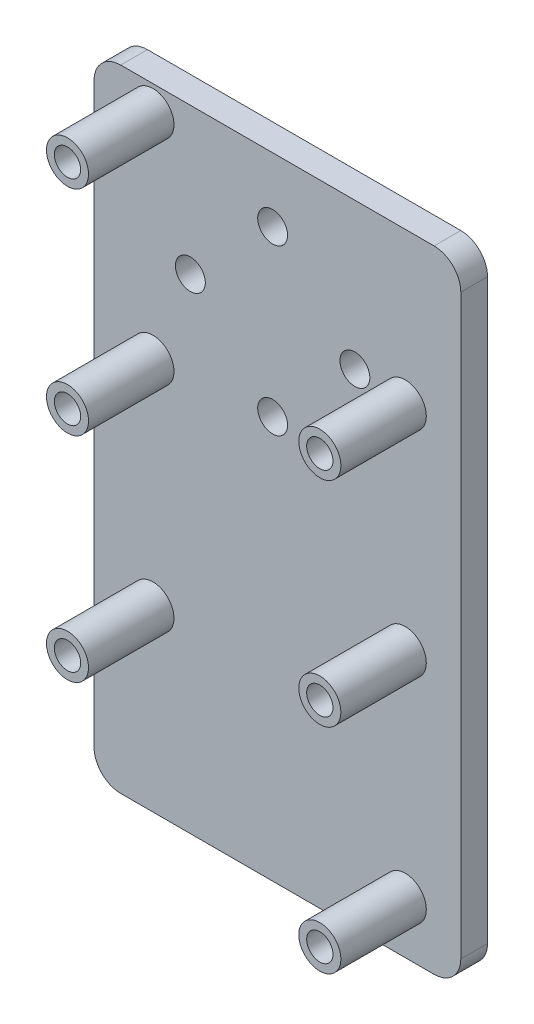
ISO-10303-21;
HEADER;
FILE_DESCRIPTION(('STEP AP214'),'2;1');
FILE_NAME('part.step','',(''),(''),'','','');
FILE_SCHEMA(('AUTOMOTIVE_DESIGN { 1 0 10303 214 1 1 1 1 }'));
ENDSEC;
DATA;
#1=APPLICATION_CONTEXT('core data for automotive mechanical design processes');
#2=APPLICATION_PROTOCOL_DEFINITION('international standard','automotive_design',2000,#1);
#3=PRODUCT_CONTEXT('',#1,'mechanical');
#4=PRODUCT('Part','Part','',(#3));
#5=PRODUCT_RELATED_PRODUCT_CATEGORY('part','',(#4));
#6=PRODUCT_DEFINITION_FORMATION('','',#4);
#7=PRODUCT_DEFINITION_CONTEXT('part definition',#1,'design');
#8=PRODUCT_DEFINITION('design','',#6,#7);
#9=PRODUCT_DEFINITION_SHAPE('','',#8);
#10=(LENGTH_UNIT() NAMED_UNIT(*) SI_UNIT(.MILLI.,.METRE.));
#11=(NAMED_UNIT(*) PLANE_ANGLE_UNIT() SI_UNIT($,.RADIAN.));
#12=(NAMED_UNIT(*) SI_UNIT($,.STERADIAN.) SOLID_ANGLE_UNIT());
#13=UNCERTAINTY_MEASURE_WITH_UNIT(LENGTH_MEASURE(1.E-05),#10,'distance_accuracy_value','');
#14=(GEOMETRIC_REPRESENTATION_CONTEXT(3) GLOBAL_UNCERTAINTY_ASSIGNED_CONTEXT((#13)) GLOBAL_UNIT_ASSIGNED_CONTEXT((#10,
#11,#12)) REPRESENTATION_CONTEXT('',''));
#15=CARTESIAN_POINT('',(0.,0.,0.));
#16=DIRECTION('',(0.,0.,1.));
#17=DIRECTION('',(1.,0.,0.));
#18=AXIS2_PLACEMENT_3D('',#15,#16,#17);
#19=CARTESIAN_POINT('',(37.,-68.8,13.335));
#20=DIRECTION('',(0.,0.,-1.));
#21=DIRECTION('',(-1.,0.,0.));
#22=AXIS2_PLACEMENT_3D('',#19,#20,#21);
#23=CYLINDRICAL_SURFACE('',#22,2.5);
#24=CARTESIAN_POINT('',(37.,-68.8,13.335));
#25=DIRECTION('',(0.,0.,1.));
#26=DIRECTION('',(1.,0.,0.));
#27=AXIS2_PLACEMENT_3D('',#24,#25,#26);
#28=CIRCLE('',#27,2.5);
#29=CARTESIAN_POINT('',(39.5,-68.8,13.335));
#30=VERTEX_POINT('',#29);
#31=EDGE_CURVE('E162',#30,#30,#28,.T.);
#32=ORIENTED_EDGE('',*,*,#31,.F.);
#33=EDGE_LOOP('',(#32));
#34=FACE_BOUND('',#33,.T.);
#35=CARTESIAN_POINT('',(37.,-68.8,3.175));
#36=DIRECTION('',(0.,0.,1.));
#37=DIRECTION('',(1.,0.,0.));
#38=AXIS2_PLACEMENT_3D('',#35,#36,#37);
#39=CIRCLE('',#38,2.5);
#40=CARTESIAN_POINT('',(39.5,-68.8,3.175));
#41=VERTEX_POINT('',#40);
#42=EDGE_CURVE('E159',#41,#41,#39,.T.);
#43=ORIENTED_EDGE('',*,*,#42,.T.);
#44=EDGE_LOOP('',(#43));
#45=FACE_BOUND('',#44,.T.);
#46=ADVANCED_FACE('F37',(#34,#45),#23,.T.);
#47=CARTESIAN_POINT('',(37.,-68.8,13.335));
#48=DIRECTION('',(0.,0.,1.));
#49=DIRECTION('',(1.,0.,0.));
#50=AXIS2_PLACEMENT_3D('',#47,#48,#49);
#51=PLANE('',#50);
#52=CARTESIAN_POINT('',(37.,-68.8,13.335));
#53=DIRECTION('',(0.,0.,1.));
#54=DIRECTION('',(1.,0.,0.));
#55=AXIS2_PLACEMENT_3D('',#52,#53,#54);
#56=CIRCLE('',#55,1.563497);
#57=CARTESIAN_POINT('',(38.563497,-68.8,13.335));
#58=VERTEX_POINT('',#57);
#59=EDGE_CURVE('E256',#58,#58,#56,.T.);
#60=ORIENTED_EDGE('',*,*,#59,.F.);
#61=EDGE_LOOP('',(#60));
#62=FACE_BOUND('',#61,.T.);
#63=ORIENTED_EDGE('',*,*,#31,.T.);
#64=EDGE_LOOP('',(#63));
#65=FACE_BOUND('',#64,.T.);
#66=ADVANCED_FACE('F304',(#62,#65),#51,.T.);
#67=CARTESIAN_POINT('',(7.00000000000001,-53.8,13.335));
#68=DIRECTION('',(0.,0.,-1.));
#69=DIRECTION('',(-1.,0.,0.));
#70=AXIS2_PLACEMENT_3D('',#67,#68,#69);
#71=CYLINDRICAL_SURFACE('',#70,2.5);
#72=CARTESIAN_POINT('',(7.00000000000001,-53.8,13.335));
#73=DIRECTION('',(0.,0.,1.));
#74=DIRECTION('',(1.,0.,0.));
#75=AXIS2_PLACEMENT_3D('',#72,#73,#74);
#76=CIRCLE('',#75,2.5);
#77=CARTESIAN_POINT('',(9.50000000000001,-53.8,13.335));
#78=VERTEX_POINT('',#77);
#79=EDGE_CURVE('E156',#78,#78,#76,.T.);
#80=ORIENTED_EDGE('',*,*,#79,.F.);
#81=EDGE_LOOP('',(#80));
#82=FACE_BOUND('',#81,.T.);
#83=CARTESIAN_POINT('',(7.00000000000001,-53.8,3.175));
#84=DIRECTION('',(0.,0.,1.));
#85=DIRECTION('',(1.,0.,0.));
#86=AXIS2_PLACEMENT_3D('',#83,#84,#85);
#87=CIRCLE('',#86,2.5);
#88=CARTESIAN_POINT('',(9.50000000000001,-53.8,3.175));
#89=VERTEX_POINT('',#88);
#90=EDGE_CURVE('E153',#89,#89,#87,.T.);
#91=ORIENTED_EDGE('',*,*,#90,.T.);
#92=EDGE_LOOP('',(#91));
#93=FACE_BOUND('',#92,.T.);
#94=ADVANCED_FACE('F310',(#82,#93),#71,.T.);
#95=CARTESIAN_POINT('',(7.00000000000001,-53.8,13.335));
#96=DIRECTION('',(0.,0.,1.));
#97=DIRECTION('',(1.,0.,0.));
#98=AXIS2_PLACEMENT_3D('',#95,#96,#97);
#99=PLANE('',#98);
#100=CARTESIAN_POINT('',(7.00000000000001,-53.8,13.335));
#101=DIRECTION('',(0.,0.,1.));
#102=DIRECTION('',(1.,0.,0.));
#103=AXIS2_PLACEMENT_3D('',#100,#101,#102);
#104=CIRCLE('',#103,1.563497);
#105=CARTESIAN_POINT('',(8.56349700000001,-53.8,13.335));
#106=VERTEX_POINT('',#105);
#107=EDGE_CURVE('E192',#106,#106,#104,.T.);
#108=ORIENTED_EDGE('',*,*,#107,.F.);
#109=EDGE_LOOP('',(#108));
#110=FACE_BOUND('',#109,.T.);
#111=ORIENTED_EDGE('',*,*,#79,.T.);
#112=EDGE_LOOP('',(#111));
#113=FACE_BOUND('',#112,.T.);
#114=ADVANCED_FACE('F396',(#110,#113),#99,.T.);
#115=CARTESIAN_POINT('',(0.,0.,3.175));
#116=DIRECTION('',(1.,0.,0.));
#117=DIRECTION('',(0.,1.,0.));
#118=AXIS2_PLACEMENT_3D('',#115,#116,#117);
#119=PLANE('',#118);
#120=DIRECTION('',(0.,-1.,0.));
#121=VECTOR('',#120,1.);
#122=CARTESIAN_POINT('',(0.,0.,3.175));
#123=LINE('',#122,#121);
#124=CARTESIAN_POINT('',(0.,-3.175,3.175));
#125=VERTEX_POINT('',#124);
#126=CARTESIAN_POINT('',(0.,-71.825,3.175));
#127=VERTEX_POINT('',#126);
#128=EDGE_CURVE('E123',#125,#127,#123,.T.);
#129=ORIENTED_EDGE('',*,*,#128,.F.);
#130=DIRECTION('',(0.,0.,-1.));
#131=VECTOR('',#130,1.);
#132=CARTESIAN_POINT('',(0.,-3.175,3.175));
#133=LINE('',#132,#131);
#134=CARTESIAN_POINT('',(0.,-3.175,0.));
#135=VERTEX_POINT('',#134);
#136=EDGE_CURVE('E107',#125,#135,#133,.T.);
#137=ORIENTED_EDGE('',*,*,#136,.T.);
#138=DIRECTION('',(0.,-1.,0.));
#139=VECTOR('',#138,1.);
#140=CARTESIAN_POINT('',(0.,0.,0.));
#141=LINE('',#140,#139);
#142=CARTESIAN_POINT('',(0.,-71.825,0.));
#143=VERTEX_POINT('',#142);
#144=EDGE_CURVE('E120',#135,#143,#141,.T.);
#145=ORIENTED_EDGE('',*,*,#144,.T.);
#146=DIRECTION('',(0.,0.,-1.));
#147=VECTOR('',#146,1.);
#148=CARTESIAN_POINT('',(0.,-71.825,3.175));
#149=LINE('',#148,#147);
#150=EDGE_CURVE('E125',#143,#127,#149,.F.);
#151=ORIENTED_EDGE('',*,*,#150,.T.);
#152=EDGE_LOOP('',(#129,#137,#145,#151));
#153=FACE_BOUND('',#152,.T.);
#154=ADVANCED_FACE('F119',(#153),#119,.F.);
#155=CARTESIAN_POINT('',(0.,-75.,3.175));
#156=DIRECTION('',(0.,1.,0.));
#157=DIRECTION('',(0.,0.,1.));
#158=AXIS2_PLACEMENT_3D('',#155,#156,#157);
#159=PLANE('',#158);
#160=DIRECTION('',(1.,0.,0.));
#161=VECTOR('',#160,1.);
#162=CARTESIAN_POINT('',(0.,-75.,0.));
#163=LINE('',#162,#161);
#164=CARTESIAN_POINT('',(3.17500000000002,-75.,0.));
#165=VERTEX_POINT('',#164);
#166=CARTESIAN_POINT('',(40.425,-75.,0.));
#167=VERTEX_POINT('',#166);
#168=EDGE_CURVE('E129',#165,#167,#163,.T.);
#169=ORIENTED_EDGE('',*,*,#168,.T.);
#170=DIRECTION('',(0.,0.,-1.));
#171=VECTOR('',#170,1.);
#172=CARTESIAN_POINT('',(40.425,-75.,3.175));
#173=LINE('',#172,#171);
#174=CARTESIAN_POINT('',(40.425,-75.,3.175));
#175=VERTEX_POINT('',#174);
#176=EDGE_CURVE('E11',#167,#175,#173,.F.);
#177=ORIENTED_EDGE('',*,*,#176,.T.);
#178=DIRECTION('',(1.,0.,0.));
#179=VECTOR('',#178,1.);
#180=CARTESIAN_POINT('',(0.,-75.,3.175));
#181=LINE('',#180,#179);
#182=CARTESIAN_POINT('',(3.17500000000002,-75.,3.175));
#183=VERTEX_POINT('',#182);
#184=EDGE_CURVE('E217',#183,#175,#181,.T.);
#185=ORIENTED_EDGE('',*,*,#184,.F.);
#186=DIRECTION('',(0.,0.,-1.));
#187=VECTOR('',#186,1.);
#188=CARTESIAN_POINT('',(3.17500000000002,-75.,3.175));
#189=LINE('',#188,#187);
#190=EDGE_CURVE('E45',#183,#165,#189,.T.);
#191=ORIENTED_EDGE('',*,*,#190,.T.);
#192=EDGE_LOOP('',(#169,#177,#185,#191));
#193=FACE_BOUND('',#192,.T.);
#194=ADVANCED_FACE('F215',(#193),#159,.F.);
#195=CARTESIAN_POINT('',(43.6,0.,3.175));
#196=DIRECTION('',(-1.,0.,0.));
#197=DIRECTION('',(0.,-1.,0.));
#198=AXIS2_PLACEMENT_3D('',#195,#196,#197);
#199=PLANE('',#198);
#200=DIRECTION('',(0.,1.,0.));
#201=VECTOR('',#200,1.);
#202=CARTESIAN_POINT('',(43.6,0.,0.));
#203=LINE('',#202,#201);
#204=CARTESIAN_POINT('',(43.6,-71.825,0.));
#205=VERTEX_POINT('',#204);
#206=CARTESIAN_POINT('',(43.6,-3.175,0.));
#207=VERTEX_POINT('',#206);
#208=EDGE_CURVE('E133',#205,#207,#203,.T.);
#209=ORIENTED_EDGE('',*,*,#208,.T.);
#210=DIRECTION('',(0.,0.,-1.));
#211=VECTOR('',#210,1.);
#212=CARTESIAN_POINT('',(43.6,-3.175,3.175));
#213=LINE('',#212,#211);
#214=CARTESIAN_POINT('',(43.6,-3.175,3.175));
#215=VERTEX_POINT('',#214);
#216=EDGE_CURVE('E52',#207,#215,#213,.F.);
#217=ORIENTED_EDGE('',*,*,#216,.T.);
#218=DIRECTION('',(0.,1.,0.));
#219=VECTOR('',#218,1.);
#220=CARTESIAN_POINT('',(43.6,0.,3.175));
#221=LINE('',#220,#219);
#222=CARTESIAN_POINT('',(43.6,-71.825,3.175));
#223=VERTEX_POINT('',#222);
#224=EDGE_CURVE('E225',#223,#215,#221,.T.);
#225=ORIENTED_EDGE('',*,*,#224,.F.);
#226=DIRECTION('',(0.,0.,-1.));
#227=VECTOR('',#226,1.);
#228=CARTESIAN_POINT('',(43.6,-71.825,3.175));
#229=LINE('',#228,#227);
#230=EDGE_CURVE('E208',#223,#205,#229,.T.);
#231=ORIENTED_EDGE('',*,*,#230,.T.);
#232=EDGE_LOOP('',(#209,#217,#225,#231));
#233=FACE_BOUND('',#232,.T.);
#234=ADVANCED_FACE('F224',(#233),#199,.F.);
#235=CARTESIAN_POINT('',(0.,0.,3.175));
#236=DIRECTION('',(0.,-1.,0.));
#237=DIRECTION('',(0.,0.,-1.));
#238=AXIS2_PLACEMENT_3D('',#235,#236,#237);
#239=PLANE('',#238);
#240=DIRECTION('',(-1.,0.,0.));
#241=VECTOR('',#240,1.);
#242=CARTESIAN_POINT('',(0.,0.,0.));
#243=LINE('',#242,#241);
#244=CARTESIAN_POINT('',(40.425,0.,0.));
#245=VERTEX_POINT('',#244);
#246=CARTESIAN_POINT('',(3.175,0.,0.));
#247=VERTEX_POINT('',#246);
#248=EDGE_CURVE('E143',#245,#247,#243,.T.);
#249=ORIENTED_EDGE('',*,*,#248,.T.);
#250=DIRECTION('',(0.,0.,-1.));
#251=VECTOR('',#250,1.);
#252=CARTESIAN_POINT('',(3.175,0.,3.175));
#253=LINE('',#252,#251);
#254=CARTESIAN_POINT('',(3.175,0.,3.175));
#255=VERTEX_POINT('',#254);
#256=EDGE_CURVE('E108',#247,#255,#253,.F.);
#257=ORIENTED_EDGE('',*,*,#256,.T.);
#258=DIRECTION('',(-1.,0.,0.));
#259=VECTOR('',#258,1.);
#260=CARTESIAN_POINT('',(0.,0.,3.175));
#261=LINE('',#260,#259);
#262=CARTESIAN_POINT('',(40.425,0.,3.175));
#263=VERTEX_POINT('',#262);
#264=EDGE_CURVE('E139',#263,#255,#261,.T.);
#265=ORIENTED_EDGE('',*,*,#264,.F.);
#266=DIRECTION('',(0.,0.,-1.));
#267=VECTOR('',#266,1.);
#268=CARTESIAN_POINT('',(40.425,0.,3.175));
#269=LINE('',#268,#267);
#270=EDGE_CURVE('E113',#263,#245,#269,.T.);
#271=ORIENTED_EDGE('',*,*,#270,.T.);
#272=EDGE_LOOP('',(#249,#257,#265,#271));
#273=FACE_BOUND('',#272,.T.);
#274=ADVANCED_FACE('F282',(#273),#239,.F.);
#275=CARTESIAN_POINT('',(0.,0.,3.175));
#276=DIRECTION('',(0.,0.,1.));
#277=DIRECTION('',(1.,0.,0.));
#278=AXIS2_PLACEMENT_3D('',#275,#276,#277);
#279=PLANE('',#278);
#280=CARTESIAN_POINT('',(21.2289321259542,-7.62,3.175));
#281=DIRECTION('',(0.,0.,1.));
#282=DIRECTION('',(1.,0.,0.));
#283=AXIS2_PLACEMENT_3D('',#280,#281,#282);
#284=CIRCLE('',#283,1.778);
#285=CARTESIAN_POINT('',(23.0069321259542,-7.62,3.175));
#286=VERTEX_POINT('',#285);
#287=EDGE_CURVE('E183',#286,#286,#284,.T.);
#288=ORIENTED_EDGE('',*,*,#287,.F.);
#289=EDGE_LOOP('',(#288));
#290=FACE_BOUND('',#289,.T.);
#291=CARTESIAN_POINT('',(21.2289321259542,-27.178,3.175));
#292=DIRECTION('',(0.,0.,1.));
#293=DIRECTION('',(1.,0.,0.));
#294=AXIS2_PLACEMENT_3D('',#291,#292,#293);
#295=CIRCLE('',#294,1.77800000000001);
#296=CARTESIAN_POINT('',(23.0069321259542,-27.178,3.175));
#297=VERTEX_POINT('',#296);
#298=EDGE_CURVE('E270',#297,#297,#295,.T.);
#299=ORIENTED_EDGE('',*,*,#298,.F.);
#300=EDGE_LOOP('',(#299));
#301=FACE_BOUND('',#300,.T.);
#302=CARTESIAN_POINT('',(11.4499321259542,-17.399,3.175));
#303=DIRECTION('',(0.,0.,1.));
#304=DIRECTION('',(1.,0.,0.));
#305=AXIS2_PLACEMENT_3D('',#302,#303,#304);
#306=CIRCLE('',#305,1.778);
#307=CARTESIAN_POINT('',(13.2279321259542,-17.399,3.175));
#308=VERTEX_POINT('',#307);
#309=EDGE_CURVE('E267',#308,#308,#306,.T.);
#310=ORIENTED_EDGE('',*,*,#309,.F.);
#311=EDGE_LOOP('',(#310));
#312=FACE_BOUND('',#311,.T.);
#313=CARTESIAN_POINT('',(31.0079321259542,-17.399,3.175));
#314=DIRECTION('',(0.,0.,1.));
#315=DIRECTION('',(1.,0.,0.));
#316=AXIS2_PLACEMENT_3D('',#313,#314,#315);
#317=CIRCLE('',#316,1.778);
#318=CARTESIAN_POINT('',(32.7859321259542,-17.399,3.175));
#319=VERTEX_POINT('',#318);
#320=EDGE_CURVE('E264',#319,#319,#317,.T.);
#321=ORIENTED_EDGE('',*,*,#320,.F.);
#322=EDGE_LOOP('',(#321));
#323=FACE_BOUND('',#322,.T.);
#324=CARTESIAN_POINT('',(37.,-43.4,3.175));
#325=DIRECTION('',(0.,0.,1.));
#326=DIRECTION('',(1.,0.,0.));
#327=AXIS2_PLACEMENT_3D('',#324,#325,#326);
#328=CIRCLE('',#327,2.5);
#329=CARTESIAN_POINT('',(39.5,-43.4,3.175));
#330=VERTEX_POINT('',#329);
#331=EDGE_CURVE('E178',#330,#330,#328,.T.);
#332=ORIENTED_EDGE('',*,*,#331,.F.);
#333=EDGE_LOOP('',(#332));
#334=FACE_BOUND('',#333,.T.);
#335=CARTESIAN_POINT('',(7.00000000000001,-28.4,3.175));
#336=DIRECTION('',(0.,0.,1.));
#337=DIRECTION('',(1.,0.,0.));
#338=AXIS2_PLACEMENT_3D('',#335,#336,#337);
#339=CIRCLE('',#338,2.5);
#340=CARTESIAN_POINT('',(9.50000000000001,-28.4,3.175));
#341=VERTEX_POINT('',#340);
#342=EDGE_CURVE('E246',#341,#341,#339,.T.);
#343=ORIENTED_EDGE('',*,*,#342,.F.);
#344=EDGE_LOOP('',(#343));
#345=FACE_BOUND('',#344,.T.);
#346=CARTESIAN_POINT('',(7.,-3.,3.175));
#347=DIRECTION('',(0.,0.,1.));
#348=DIRECTION('',(1.,0.,0.));
#349=AXIS2_PLACEMENT_3D('',#346,#347,#348);
#350=CIRCLE('',#349,2.5);
#351=CARTESIAN_POINT('',(9.5,-3.,3.175));
#352=VERTEX_POINT('',#351);
#353=EDGE_CURVE('E237',#352,#352,#350,.T.);
#354=ORIENTED_EDGE('',*,*,#353,.F.);
#355=EDGE_LOOP('',(#354));
#356=FACE_BOUND('',#355,.T.);
#357=CARTESIAN_POINT('',(37.,-18.,3.175));
#358=DIRECTION('',(0.,0.,1.));
#359=DIRECTION('',(1.,0.,0.));
#360=AXIS2_PLACEMENT_3D('',#357,#358,#359);
#361=CIRCLE('',#360,2.5);
#362=CARTESIAN_POINT('',(39.5,-18.,3.175));
#363=VERTEX_POINT('',#362);
#364=EDGE_CURVE('E136',#363,#363,#361,.T.);
#365=ORIENTED_EDGE('',*,*,#364,.F.);
#366=EDGE_LOOP('',(#365));
#367=FACE_BOUND('',#366,.T.);
#368=ORIENTED_EDGE('',*,*,#264,.T.);
#369=CARTESIAN_POINT('',(3.175,-3.175,3.175));
#370=DIRECTION('',(0.,0.,1.));
#371=DIRECTION('',(1.,0.,0.));
#372=AXIS2_PLACEMENT_3D('',#369,#370,#371);
#373=CIRCLE('',#372,3.175);
#374=EDGE_CURVE('E206',#255,#125,#373,.T.);
#375=ORIENTED_EDGE('',*,*,#374,.T.);
#376=ORIENTED_EDGE('',*,*,#128,.T.);
#377=CARTESIAN_POINT('',(3.17500000000002,-71.825,3.175));
#378=DIRECTION('',(0.,0.,1.));
#379=DIRECTION('',(1.,0.,0.));
#380=AXIS2_PLACEMENT_3D('',#377,#378,#379);
#381=CIRCLE('',#380,3.175);
#382=EDGE_CURVE('E201',#127,#183,#381,.T.);
#383=ORIENTED_EDGE('',*,*,#382,.T.);
#384=ORIENTED_EDGE('',*,*,#184,.T.);
#385=CARTESIAN_POINT('',(40.425,-71.825,3.175));
#386=DIRECTION('',(0.,0.,1.));
#387=DIRECTION('',(1.,0.,0.));
#388=AXIS2_PLACEMENT_3D('',#385,#386,#387);
#389=CIRCLE('',#388,3.175);
#390=EDGE_CURVE('E59',#175,#223,#389,.T.);
#391=ORIENTED_EDGE('',*,*,#390,.T.);
#392=ORIENTED_EDGE('',*,*,#224,.T.);
#393=CARTESIAN_POINT('',(40.425,-3.175,3.175));
#394=DIRECTION('',(0.,0.,1.));
#395=DIRECTION('',(1.,0.,0.));
#396=AXIS2_PLACEMENT_3D('',#393,#394,#395);
#397=CIRCLE('',#396,3.175);
#398=EDGE_CURVE('E204',#215,#263,#397,.T.);
#399=ORIENTED_EDGE('',*,*,#398,.T.);
#400=EDGE_LOOP('',(#368,#375,#376,#383,#384,#391,#392,#399));
#401=FACE_BOUND('',#400,.T.);
#402=ORIENTED_EDGE('',*,*,#90,.F.);
#403=EDGE_LOOP('',(#402));
#404=FACE_BOUND('',#403,.T.);
#405=ORIENTED_EDGE('',*,*,#42,.F.);
#406=EDGE_LOOP('',(#405));
#407=FACE_BOUND('',#406,.T.);
#408=ADVANCED_FACE('F279',(#290,#301,#312,#323,#334,#345,#356,#367,#401,#404,#407),#279,.T.);
#409=CARTESIAN_POINT('',(0.,0.,0.));
#410=DIRECTION('',(0.,0.,1.));
#411=DIRECTION('',(1.,0.,0.));
#412=AXIS2_PLACEMENT_3D('',#409,#410,#411);
#413=PLANE('',#412);
#414=CARTESIAN_POINT('',(21.2289321259542,-7.62,0.));
#415=DIRECTION('',(0.,0.,1.));
#416=DIRECTION('',(1.,0.,0.));
#417=AXIS2_PLACEMENT_3D('',#414,#415,#416);
#418=CIRCLE('',#417,1.778);
#419=CARTESIAN_POINT('',(23.0069321259542,-7.62,0.));
#420=VERTEX_POINT('',#419);
#421=EDGE_CURVE('E189',#420,#420,#418,.T.);
#422=ORIENTED_EDGE('',*,*,#421,.T.);
#423=EDGE_LOOP('',(#422));
#424=FACE_BOUND('',#423,.T.);
#425=CARTESIAN_POINT('',(21.2289321259542,-27.178,0.));
#426=DIRECTION('',(0.,0.,1.));
#427=DIRECTION('',(1.,0.,0.));
#428=AXIS2_PLACEMENT_3D('',#425,#426,#427);
#429=CIRCLE('',#428,1.77800000000001);
#430=CARTESIAN_POINT('',(23.0069321259542,-27.178,0.));
#431=VERTEX_POINT('',#430);
#432=EDGE_CURVE('E186',#431,#431,#429,.T.);
#433=ORIENTED_EDGE('',*,*,#432,.T.);
#434=EDGE_LOOP('',(#433));
#435=FACE_BOUND('',#434,.T.);
#436=CARTESIAN_POINT('',(11.4499321259542,-17.399,0.));
#437=DIRECTION('',(0.,0.,1.));
#438=DIRECTION('',(1.,0.,0.));
#439=AXIS2_PLACEMENT_3D('',#436,#437,#438);
#440=CIRCLE('',#439,1.778);
#441=CARTESIAN_POINT('',(13.2279321259542,-17.399,0.));
#442=VERTEX_POINT('',#441);
#443=EDGE_CURVE('E182',#442,#442,#440,.T.);
#444=ORIENTED_EDGE('',*,*,#443,.T.);
#445=EDGE_LOOP('',(#444));
#446=FACE_BOUND('',#445,.T.);
#447=CARTESIAN_POINT('',(31.0079321259542,-17.399,0.));
#448=DIRECTION('',(0.,0.,1.));
#449=DIRECTION('',(1.,0.,0.));
#450=AXIS2_PLACEMENT_3D('',#447,#448,#449);
#451=CIRCLE('',#450,1.778);
#452=CARTESIAN_POINT('',(32.7859321259542,-17.399,0.));
#453=VERTEX_POINT('',#452);
#454=EDGE_CURVE('E179',#453,#453,#451,.T.);
#455=ORIENTED_EDGE('',*,*,#454,.T.);
#456=EDGE_LOOP('',(#455));
#457=FACE_BOUND('',#456,.T.);
#458=CARTESIAN_POINT('',(7.00000000000001,-28.4,0.));
#459=DIRECTION('',(0.,0.,1.));
#460=DIRECTION('',(1.,0.,0.));
#461=AXIS2_PLACEMENT_3D('',#458,#459,#460);
#462=CIRCLE('',#461,1.563497);
#463=CARTESIAN_POINT('',(8.56349700000001,-28.4,0.));
#464=VERTEX_POINT('',#463);
#465=EDGE_CURVE('E175',#464,#464,#462,.T.);
#466=ORIENTED_EDGE('',*,*,#465,.T.);
#467=EDGE_LOOP('',(#466));
#468=FACE_BOUND('',#467,.T.);
#469=CARTESIAN_POINT('',(37.,-43.4,0.));
#470=DIRECTION('',(0.,0.,1.));
#471=DIRECTION('',(1.,0.,0.));
#472=AXIS2_PLACEMENT_3D('',#469,#470,#471);
#473=CIRCLE('',#472,1.563497);
#474=CARTESIAN_POINT('',(38.563497,-43.4,0.));
#475=VERTEX_POINT('',#474);
#476=EDGE_CURVE('E172',#475,#475,#473,.T.);
#477=ORIENTED_EDGE('',*,*,#476,.T.);
#478=EDGE_LOOP('',(#477));
#479=FACE_BOUND('',#478,.T.);
#480=CARTESIAN_POINT('',(7.00000000000001,-53.8,0.));
#481=DIRECTION('',(0.,0.,1.));
#482=DIRECTION('',(1.,0.,0.));
#483=AXIS2_PLACEMENT_3D('',#480,#481,#482);
#484=CIRCLE('',#483,1.563497);
#485=CARTESIAN_POINT('',(8.56349700000001,-53.8,0.));
#486=VERTEX_POINT('',#485);
#487=EDGE_CURVE('E168',#486,#486,#484,.T.);
#488=ORIENTED_EDGE('',*,*,#487,.T.);
#489=EDGE_LOOP('',(#488));
#490=FACE_BOUND('',#489,.T.);
#491=CARTESIAN_POINT('',(37.,-68.8,0.));
#492=DIRECTION('',(0.,0.,1.));
#493=DIRECTION('',(1.,0.,0.));
#494=AXIS2_PLACEMENT_3D('',#491,#492,#493);
#495=CIRCLE('',#494,1.563497);
#496=CARTESIAN_POINT('',(38.563497,-68.8,0.));
#497=VERTEX_POINT('',#496);
#498=EDGE_CURVE('E165',#497,#497,#495,.T.);
#499=ORIENTED_EDGE('',*,*,#498,.T.);
#500=EDGE_LOOP('',(#499));
#501=FACE_BOUND('',#500,.T.);
#502=CARTESIAN_POINT('',(7.,-3.,0.));
#503=DIRECTION('',(0.,0.,1.));
#504=DIRECTION('',(1.,0.,0.));
#505=AXIS2_PLACEMENT_3D('',#502,#503,#504);
#506=CIRCLE('',#505,1.563497);
#507=CARTESIAN_POINT('',(8.563497,-3.,0.));
#508=VERTEX_POINT('',#507);
#509=EDGE_CURVE('E148',#508,#508,#506,.T.);
#510=ORIENTED_EDGE('',*,*,#509,.T.);
#511=EDGE_LOOP('',(#510));
#512=FACE_BOUND('',#511,.T.);
#513=CARTESIAN_POINT('',(37.,-18.,0.));
#514=DIRECTION('',(0.,0.,1.));
#515=DIRECTION('',(1.,0.,0.));
#516=AXIS2_PLACEMENT_3D('',#513,#514,#515);
#517=CIRCLE('',#516,1.563497);
#518=CARTESIAN_POINT('',(38.563497,-18.,0.));
#519=VERTEX_POINT('',#518);
#520=EDGE_CURVE('E145',#519,#519,#517,.T.);
#521=ORIENTED_EDGE('',*,*,#520,.T.);
#522=EDGE_LOOP('',(#521));
#523=FACE_BOUND('',#522,.T.);
#524=ORIENTED_EDGE('',*,*,#144,.F.);
#525=CARTESIAN_POINT('',(3.175,-3.175,0.));
#526=DIRECTION('',(0.,0.,1.));
#527=DIRECTION('',(1.,0.,0.));
#528=AXIS2_PLACEMENT_3D('',#525,#526,#527);
#529=CIRCLE('',#528,3.175);
#530=EDGE_CURVE('E103',#135,#247,#529,.F.);
#531=ORIENTED_EDGE('',*,*,#530,.T.);
#532=ORIENTED_EDGE('',*,*,#248,.F.);
#533=CARTESIAN_POINT('',(40.425,-3.175,0.));
#534=DIRECTION('',(0.,0.,1.));
#535=DIRECTION('',(1.,0.,0.));
#536=AXIS2_PLACEMENT_3D('',#533,#534,#535);
#537=CIRCLE('',#536,3.175);
#538=EDGE_CURVE('E114',#245,#207,#537,.F.);
#539=ORIENTED_EDGE('',*,*,#538,.T.);
#540=ORIENTED_EDGE('',*,*,#208,.F.);
#541=CARTESIAN_POINT('',(40.425,-71.825,0.));
#542=DIRECTION('',(0.,0.,1.));
#543=DIRECTION('',(1.,0.,0.));
#544=AXIS2_PLACEMENT_3D('',#541,#542,#543);
#545=CIRCLE('',#544,3.175);
#546=EDGE_CURVE('E195',#205,#167,#545,.F.);
#547=ORIENTED_EDGE('',*,*,#546,.T.);
#548=ORIENTED_EDGE('',*,*,#168,.F.);
#549=CARTESIAN_POINT('',(3.17500000000002,-71.825,0.));
#550=DIRECTION('',(0.,0.,1.));
#551=DIRECTION('',(1.,0.,0.));
#552=AXIS2_PLACEMENT_3D('',#549,#550,#551);
#553=CIRCLE('',#552,3.175);
#554=EDGE_CURVE('E124',#165,#143,#553,.F.);
#555=ORIENTED_EDGE('',*,*,#554,.T.);
#556=EDGE_LOOP('',(#524,#531,#532,#539,#540,#547,#548,#555));
#557=FACE_BOUND('',#556,.T.);
#558=ADVANCED_FACE('F127',(#424,#435,#446,#457,#468,#479,#490,#501,#512,#523,#557),#413,.F.);
#559=CARTESIAN_POINT('',(37.,-18.,13.335));
#560=DIRECTION('',(0.,0.,1.));
#561=DIRECTION('',(1.,0.,0.));
#562=AXIS2_PLACEMENT_3D('',#559,#560,#561);
#563=PLANE('',#562);
#564=CARTESIAN_POINT('',(37.,-18.,13.335));
#565=DIRECTION('',(0.,0.,1.));
#566=DIRECTION('',(1.,0.,0.));
#567=AXIS2_PLACEMENT_3D('',#564,#565,#566);
#568=CIRCLE('',#567,2.5);
#569=CARTESIAN_POINT('',(39.5,-18.,13.335));
#570=VERTEX_POINT('',#569);
#571=EDGE_CURVE('E130',#570,#570,#568,.T.);
#572=ORIENTED_EDGE('',*,*,#571,.T.);
#573=EDGE_LOOP('',(#572));
#574=FACE_BOUND('',#573,.T.);
#575=CARTESIAN_POINT('',(37.,-18.,13.335));
#576=DIRECTION('',(0.,0.,1.));
#577=DIRECTION('',(1.,0.,0.));
#578=AXIS2_PLACEMENT_3D('',#575,#576,#577);
#579=CIRCLE('',#578,1.563497);
#580=CARTESIAN_POINT('',(38.563497,-18.,13.335));
#581=VERTEX_POINT('',#580);
#582=EDGE_CURVE('E232',#581,#581,#579,.T.);
#583=ORIENTED_EDGE('',*,*,#582,.F.);
#584=EDGE_LOOP('',(#583));
#585=FACE_BOUND('',#584,.T.);
#586=ADVANCED_FACE('F354',(#574,#585),#563,.T.);
#587=CARTESIAN_POINT('',(37.,-18.,13.335));
#588=DIRECTION('',(0.,0.,-1.));
#589=DIRECTION('',(-1.,0.,0.));
#590=AXIS2_PLACEMENT_3D('',#587,#588,#589);
#591=CYLINDRICAL_SURFACE('',#590,2.5);
#592=ORIENTED_EDGE('',*,*,#571,.F.);
#593=EDGE_LOOP('',(#592));
#594=FACE_BOUND('',#593,.T.);
#595=ORIENTED_EDGE('',*,*,#364,.T.);
#596=EDGE_LOOP('',(#595));
#597=FACE_BOUND('',#596,.T.);
#598=ADVANCED_FACE('F567',(#594,#597),#591,.T.);
#599=CARTESIAN_POINT('',(37.,-18.,13.335));
#600=DIRECTION('',(0.,0.,-1.));
#601=DIRECTION('',(-1.,0.,0.));
#602=AXIS2_PLACEMENT_3D('',#599,#600,#601);
#603=CYLINDRICAL_SURFACE('',#602,1.563497);
#604=ORIENTED_EDGE('',*,*,#582,.T.);
#605=EDGE_LOOP('',(#604));
#606=FACE_BOUND('',#605,.T.);
#607=ORIENTED_EDGE('',*,*,#520,.F.);
#608=EDGE_LOOP('',(#607));
#609=FACE_BOUND('',#608,.T.);
#610=ADVANCED_FACE('F562',(#606,#609),#603,.F.);
#611=CARTESIAN_POINT('',(7.,-3.,13.335));
#612=DIRECTION('',(0.,0.,1.));
#613=DIRECTION('',(1.,0.,0.));
#614=AXIS2_PLACEMENT_3D('',#611,#612,#613);
#615=PLANE('',#614);
#616=CARTESIAN_POINT('',(7.,-3.,13.335));
#617=DIRECTION('',(0.,0.,1.));
#618=DIRECTION('',(1.,0.,0.));
#619=AXIS2_PLACEMENT_3D('',#616,#617,#618);
#620=CIRCLE('',#619,2.5);
#621=CARTESIAN_POINT('',(9.5,-3.,13.335));
#622=VERTEX_POINT('',#621);
#623=EDGE_CURVE('E236',#622,#622,#620,.T.);
#624=ORIENTED_EDGE('',*,*,#623,.T.);
#625=EDGE_LOOP('',(#624));
#626=FACE_BOUND('',#625,.T.);
#627=CARTESIAN_POINT('',(7.,-3.,13.335));
#628=DIRECTION('',(0.,0.,1.));
#629=DIRECTION('',(1.,0.,0.));
#630=AXIS2_PLACEMENT_3D('',#627,#628,#629);
#631=CIRCLE('',#630,1.563497);
#632=CARTESIAN_POINT('',(8.563497,-3.,13.335));
#633=VERTEX_POINT('',#632);
#634=EDGE_CURVE('E152',#633,#633,#631,.T.);
#635=ORIENTED_EDGE('',*,*,#634,.F.);
#636=EDGE_LOOP('',(#635));
#637=FACE_BOUND('',#636,.T.);
#638=ADVANCED_FACE('F566',(#626,#637),#615,.T.);
#639=CARTESIAN_POINT('',(7.,-3.,13.335));
#640=DIRECTION('',(0.,0.,-1.));
#641=DIRECTION('',(-1.,0.,0.));
#642=AXIS2_PLACEMENT_3D('',#639,#640,#641);
#643=CYLINDRICAL_SURFACE('',#642,2.5);
#644=ORIENTED_EDGE('',*,*,#623,.F.);
#645=EDGE_LOOP('',(#644));
#646=FACE_BOUND('',#645,.T.);
#647=ORIENTED_EDGE('',*,*,#353,.T.);
#648=EDGE_LOOP('',(#647));
#649=FACE_BOUND('',#648,.T.);
#650=ADVANCED_FACE('F553',(#646,#649),#643,.T.);
#651=CARTESIAN_POINT('',(7.,-3.,13.335));
#652=DIRECTION('',(0.,0.,-1.));
#653=DIRECTION('',(-1.,0.,0.));
#654=AXIS2_PLACEMENT_3D('',#651,#652,#653);
#655=CYLINDRICAL_SURFACE('',#654,1.563497);
#656=ORIENTED_EDGE('',*,*,#634,.T.);
#657=EDGE_LOOP('',(#656));
#658=FACE_BOUND('',#657,.T.);
#659=ORIENTED_EDGE('',*,*,#509,.F.);
#660=EDGE_LOOP('',(#659));
#661=FACE_BOUND('',#660,.T.);
#662=ADVANCED_FACE('F503',(#658,#661),#655,.F.);
#663=CARTESIAN_POINT('',(7.00000000000001,-28.4,13.335));
#664=DIRECTION('',(0.,0.,1.));
#665=DIRECTION('',(1.,0.,0.));
#666=AXIS2_PLACEMENT_3D('',#663,#664,#665);
#667=PLANE('',#666);
#668=CARTESIAN_POINT('',(7.00000000000001,-28.4,13.335));
#669=DIRECTION('',(0.,0.,1.));
#670=DIRECTION('',(1.,0.,0.));
#671=AXIS2_PLACEMENT_3D('',#668,#669,#670);
#672=CIRCLE('',#671,1.563497);
#673=CARTESIAN_POINT('',(8.56349700000001,-28.4,13.335));
#674=VERTEX_POINT('',#673);
#675=EDGE_CURVE('E169',#674,#674,#672,.T.);
#676=ORIENTED_EDGE('',*,*,#675,.F.);
#677=EDGE_LOOP('',(#676));
#678=FACE_BOUND('',#677,.T.);
#679=CARTESIAN_POINT('',(7.00000000000001,-28.4,13.335));
#680=DIRECTION('',(0.,0.,1.));
#681=DIRECTION('',(1.,0.,0.));
#682=AXIS2_PLACEMENT_3D('',#679,#680,#681);
#683=CIRCLE('',#682,2.5);
#684=CARTESIAN_POINT('',(9.50000000000001,-28.4,13.335));
#685=VERTEX_POINT('',#684);
#686=EDGE_CURVE('E149',#685,#685,#683,.T.);
#687=ORIENTED_EDGE('',*,*,#686,.T.);
#688=EDGE_LOOP('',(#687));
#689=FACE_BOUND('',#688,.T.);
#690=ADVANCED_FACE('F498',(#678,#689),#667,.T.);
#691=CARTESIAN_POINT('',(7.00000000000001,-28.4,13.335));
#692=DIRECTION('',(0.,0.,-1.));
#693=DIRECTION('',(-1.,0.,0.));
#694=AXIS2_PLACEMENT_3D('',#691,#692,#693);
#695=CYLINDRICAL_SURFACE('',#694,2.5);
#696=ORIENTED_EDGE('',*,*,#686,.F.);
#697=EDGE_LOOP('',(#696));
#698=FACE_BOUND('',#697,.T.);
#699=ORIENTED_EDGE('',*,*,#342,.T.);
#700=EDGE_LOOP('',(#699));
#701=FACE_BOUND('',#700,.T.);
#702=ADVANCED_FACE('F489',(#698,#701),#695,.T.);
#703=CARTESIAN_POINT('',(37.,-43.4,13.335));
#704=DIRECTION('',(0.,0.,1.));
#705=DIRECTION('',(1.,0.,0.));
#706=AXIS2_PLACEMENT_3D('',#703,#704,#705);
#707=PLANE('',#706);
#708=CARTESIAN_POINT('',(37.,-43.4,13.335));
#709=DIRECTION('',(0.,0.,1.));
#710=DIRECTION('',(1.,0.,0.));
#711=AXIS2_PLACEMENT_3D('',#708,#709,#710);
#712=CIRCLE('',#711,1.563497);
#713=CARTESIAN_POINT('',(38.563497,-43.4,13.335));
#714=VERTEX_POINT('',#713);
#715=EDGE_CURVE('E259',#714,#714,#712,.T.);
#716=ORIENTED_EDGE('',*,*,#715,.F.);
#717=EDGE_LOOP('',(#716));
#718=FACE_BOUND('',#717,.T.);
#719=CARTESIAN_POINT('',(37.,-43.4,13.335));
#720=DIRECTION('',(0.,0.,1.));
#721=DIRECTION('',(1.,0.,0.));
#722=AXIS2_PLACEMENT_3D('',#719,#720,#721);
#723=CIRCLE('',#722,2.5);
#724=CARTESIAN_POINT('',(39.5,-43.4,13.335));
#725=VERTEX_POINT('',#724);
#726=EDGE_CURVE('E249',#725,#725,#723,.T.);
#727=ORIENTED_EDGE('',*,*,#726,.T.);
#728=EDGE_LOOP('',(#727));
#729=FACE_BOUND('',#728,.T.);
#730=ADVANCED_FACE('F484',(#718,#729),#707,.T.);
#731=CARTESIAN_POINT('',(37.,-43.4,13.335));
#732=DIRECTION('',(0.,0.,-1.));
#733=DIRECTION('',(-1.,0.,0.));
#734=AXIS2_PLACEMENT_3D('',#731,#732,#733);
#735=CYLINDRICAL_SURFACE('',#734,2.5);
#736=ORIENTED_EDGE('',*,*,#726,.F.);
#737=EDGE_LOOP('',(#736));
#738=FACE_BOUND('',#737,.T.);
#739=ORIENTED_EDGE('',*,*,#331,.T.);
#740=EDGE_LOOP('',(#739));
#741=FACE_BOUND('',#740,.T.);
#742=ADVANCED_FACE('F476',(#738,#741),#735,.T.);
#743=CARTESIAN_POINT('',(37.,-68.8,-6.985));
#744=DIRECTION('',(0.,0.,1.));
#745=DIRECTION('',(1.,0.,0.));
#746=AXIS2_PLACEMENT_3D('',#743,#744,#745);
#747=CYLINDRICAL_SURFACE('',#746,1.563497);
#748=ORIENTED_EDGE('',*,*,#498,.F.);
#749=EDGE_LOOP('',(#748));
#750=FACE_BOUND('',#749,.T.);
#751=ORIENTED_EDGE('',*,*,#59,.T.);
#752=EDGE_LOOP('',(#751));
#753=FACE_BOUND('',#752,.T.);
#754=ADVANCED_FACE('F465',(#750,#753),#747,.F.);
#755=CARTESIAN_POINT('',(7.00000000000001,-53.8,-6.985));
#756=DIRECTION('',(0.,0.,1.));
#757=DIRECTION('',(1.,0.,0.));
#758=AXIS2_PLACEMENT_3D('',#755,#756,#757);
#759=CYLINDRICAL_SURFACE('',#758,1.563497);
#760=ORIENTED_EDGE('',*,*,#487,.F.);
#761=EDGE_LOOP('',(#760));
#762=FACE_BOUND('',#761,.T.);
#763=ORIENTED_EDGE('',*,*,#107,.T.);
#764=EDGE_LOOP('',(#763));
#765=FACE_BOUND('',#764,.T.);
#766=ADVANCED_FACE('F454',(#762,#765),#759,.F.);
#767=CARTESIAN_POINT('',(37.,-43.4,-6.985));
#768=DIRECTION('',(0.,0.,1.));
#769=DIRECTION('',(1.,0.,0.));
#770=AXIS2_PLACEMENT_3D('',#767,#768,#769);
#771=CYLINDRICAL_SURFACE('',#770,1.563497);
#772=ORIENTED_EDGE('',*,*,#476,.F.);
#773=EDGE_LOOP('',(#772));
#774=FACE_BOUND('',#773,.T.);
#775=ORIENTED_EDGE('',*,*,#715,.T.);
#776=EDGE_LOOP('',(#775));
#777=FACE_BOUND('',#776,.T.);
#778=ADVANCED_FACE('F443',(#774,#777),#771,.F.);
#779=CARTESIAN_POINT('',(7.00000000000001,-28.4,-6.985));
#780=DIRECTION('',(0.,0.,1.));
#781=DIRECTION('',(1.,0.,0.));
#782=AXIS2_PLACEMENT_3D('',#779,#780,#781);
#783=CYLINDRICAL_SURFACE('',#782,1.563497);
#784=ORIENTED_EDGE('',*,*,#465,.F.);
#785=EDGE_LOOP('',(#784));
#786=FACE_BOUND('',#785,.T.);
#787=ORIENTED_EDGE('',*,*,#675,.T.);
#788=EDGE_LOOP('',(#787));
#789=FACE_BOUND('',#788,.T.);
#790=ADVANCED_FACE('F433',(#786,#789),#783,.F.);
#791=CARTESIAN_POINT('',(31.0079321259542,-17.399,-17.145));
#792=DIRECTION('',(0.,0.,1.));
#793=DIRECTION('',(1.,0.,0.));
#794=AXIS2_PLACEMENT_3D('',#791,#792,#793);
#795=CYLINDRICAL_SURFACE('',#794,1.778);
#796=ORIENTED_EDGE('',*,*,#320,.T.);
#797=EDGE_LOOP('',(#796));
#798=FACE_BOUND('',#797,.T.);
#799=ORIENTED_EDGE('',*,*,#454,.F.);
#800=EDGE_LOOP('',(#799));
#801=FACE_BOUND('',#800,.T.);
#802=ADVANCED_FACE('F423',(#798,#801),#795,.F.);
#803=CARTESIAN_POINT('',(11.4499321259542,-17.399,-17.145));
#804=DIRECTION('',(0.,0.,1.));
#805=DIRECTION('',(1.,0.,0.));
#806=AXIS2_PLACEMENT_3D('',#803,#804,#805);
#807=CYLINDRICAL_SURFACE('',#806,1.778);
#808=ORIENTED_EDGE('',*,*,#309,.T.);
#809=EDGE_LOOP('',(#808));
#810=FACE_BOUND('',#809,.T.);
#811=ORIENTED_EDGE('',*,*,#443,.F.);
#812=EDGE_LOOP('',(#811));
#813=FACE_BOUND('',#812,.T.);
#814=ADVANCED_FACE('F413',(#810,#813),#807,.F.);
#815=CARTESIAN_POINT('',(21.2289321259542,-27.178,-17.145));
#816=DIRECTION('',(0.,0.,1.));
#817=DIRECTION('',(1.,0.,0.));
#818=AXIS2_PLACEMENT_3D('',#815,#816,#817);
#819=CYLINDRICAL_SURFACE('',#818,1.77800000000001);
#820=ORIENTED_EDGE('',*,*,#298,.T.);
#821=EDGE_LOOP('',(#820));
#822=FACE_BOUND('',#821,.T.);
#823=ORIENTED_EDGE('',*,*,#432,.F.);
#824=EDGE_LOOP('',(#823));
#825=FACE_BOUND('',#824,.T.);
#826=ADVANCED_FACE('F404',(#822,#825),#819,.F.);
#827=CARTESIAN_POINT('',(21.2289321259542,-7.62,-17.145));
#828=DIRECTION('',(0.,0.,1.));
#829=DIRECTION('',(1.,0.,0.));
#830=AXIS2_PLACEMENT_3D('',#827,#828,#829);
#831=CYLINDRICAL_SURFACE('',#830,1.778);
#832=ORIENTED_EDGE('',*,*,#287,.T.);
#833=EDGE_LOOP('',(#832));
#834=FACE_BOUND('',#833,.T.);
#835=ORIENTED_EDGE('',*,*,#421,.F.);
#836=EDGE_LOOP('',(#835));
#837=FACE_BOUND('',#836,.T.);
#838=ADVANCED_FACE('F276',(#834,#837),#831,.F.);
#839=CARTESIAN_POINT('',(3.175,-3.175,3.175));
#840=DIRECTION('',(0.,0.,-1.));
#841=DIRECTION('',(-1.,0.,0.));
#842=AXIS2_PLACEMENT_3D('',#839,#840,#841);
#843=CYLINDRICAL_SURFACE('',#842,3.175);
#844=ORIENTED_EDGE('',*,*,#374,.F.);
#845=ORIENTED_EDGE('',*,*,#256,.F.);
#846=ORIENTED_EDGE('',*,*,#530,.F.);
#847=ORIENTED_EDGE('',*,*,#136,.F.);
#848=EDGE_LOOP('',(#844,#845,#846,#847));
#849=FACE_BOUND('',#848,.T.);
#850=ADVANCED_FACE('F106',(#849),#843,.T.);
#851=CARTESIAN_POINT('',(40.425,-3.175,3.175));
#852=DIRECTION('',(0.,0.,-1.));
#853=DIRECTION('',(-1.,0.,0.));
#854=AXIS2_PLACEMENT_3D('',#851,#852,#853);
#855=CYLINDRICAL_SURFACE('',#854,3.175);
#856=ORIENTED_EDGE('',*,*,#398,.F.);
#857=ORIENTED_EDGE('',*,*,#216,.F.);
#858=ORIENTED_EDGE('',*,*,#538,.F.);
#859=ORIENTED_EDGE('',*,*,#270,.F.);
#860=EDGE_LOOP('',(#856,#857,#858,#859));
#861=FACE_BOUND('',#860,.T.);
#862=ADVANCED_FACE('F318',(#861),#855,.T.);
#863=CARTESIAN_POINT('',(40.425,-71.825,3.175));
#864=DIRECTION('',(0.,0.,-1.));
#865=DIRECTION('',(-1.,0.,0.));
#866=AXIS2_PLACEMENT_3D('',#863,#864,#865);
#867=CYLINDRICAL_SURFACE('',#866,3.175);
#868=ORIENTED_EDGE('',*,*,#390,.F.);
#869=ORIENTED_EDGE('',*,*,#176,.F.);
#870=ORIENTED_EDGE('',*,*,#546,.F.);
#871=ORIENTED_EDGE('',*,*,#230,.F.);
#872=EDGE_LOOP('',(#868,#869,#870,#871));
#873=FACE_BOUND('',#872,.T.);
#874=ADVANCED_FACE('F223',(#873),#867,.T.);
#875=CARTESIAN_POINT('',(3.17500000000002,-71.825,3.175));
#876=DIRECTION('',(0.,0.,-1.));
#877=DIRECTION('',(-1.,0.,0.));
#878=AXIS2_PLACEMENT_3D('',#875,#876,#877);
#879=CYLINDRICAL_SURFACE('',#878,3.175);
#880=ORIENTED_EDGE('',*,*,#382,.F.);
#881=ORIENTED_EDGE('',*,*,#150,.F.);
#882=ORIENTED_EDGE('',*,*,#554,.F.);
#883=ORIENTED_EDGE('',*,*,#190,.F.);
#884=EDGE_LOOP('',(#880,#881,#882,#883));
#885=FACE_BOUND('',#884,.T.);
#886=ADVANCED_FACE('F39',(#885),#879,.T.);
#887=CLOSED_SHELL('',(#46,#66,#94,#114,#154,#194,#234,#274,#408,#558,#586,#598,#610,#638,#650,
#662,#690,#702,#730,#742,#754,#766,#778,#790,#802,#814,#826,#838,#850,#862,#874,#886));
#888=MANIFOLD_SOLID_BREP('B2',#887);
#889=ADVANCED_BREP_SHAPE_REPRESENTATION('',(#18,#888),#14);
#890=SHAPE_DEFINITION_REPRESENTATION(#9,#889);
ENDSEC;
END-ISO-10303-21;
